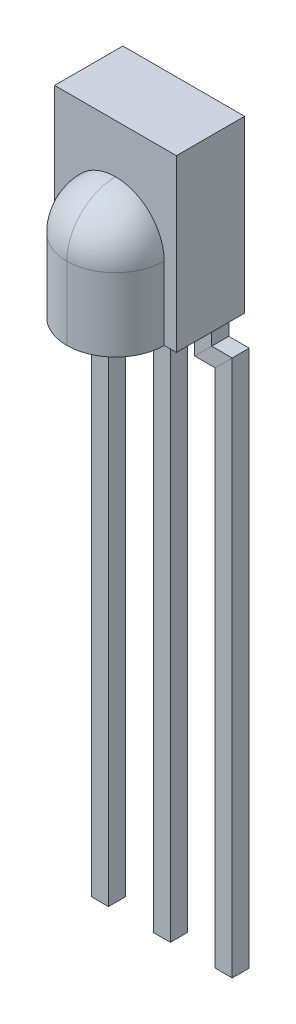
ISO-10303-21;
HEADER;
FILE_DESCRIPTION(('STEP AP214'),'2;1');
FILE_NAME('part.step','',(''),(''),'','','');
FILE_SCHEMA(('AUTOMOTIVE_DESIGN { 1 0 10303 214 1 1 1 1 }'));
ENDSEC;
DATA;
#1=APPLICATION_CONTEXT('core data for automotive mechanical design processes');
#2=APPLICATION_PROTOCOL_DEFINITION('international standard','automotive_design',2000,#1);
#3=PRODUCT_CONTEXT('',#1,'mechanical');
#4=PRODUCT('Part','Part','',(#3));
#5=PRODUCT_RELATED_PRODUCT_CATEGORY('part','',(#4));
#6=PRODUCT_DEFINITION_FORMATION('','',#4);
#7=PRODUCT_DEFINITION_CONTEXT('part definition',#1,'design');
#8=PRODUCT_DEFINITION('design','',#6,#7);
#9=PRODUCT_DEFINITION_SHAPE('','',#8);
#10=(LENGTH_UNIT() NAMED_UNIT(*) SI_UNIT(.MILLI.,.METRE.));
#11=(NAMED_UNIT(*) PLANE_ANGLE_UNIT() SI_UNIT($,.RADIAN.));
#12=(NAMED_UNIT(*) SI_UNIT($,.STERADIAN.) SOLID_ANGLE_UNIT());
#13=UNCERTAINTY_MEASURE_WITH_UNIT(LENGTH_MEASURE(1.E-05),#10,'distance_accuracy_value','');
#14=(GEOMETRIC_REPRESENTATION_CONTEXT(3) GLOBAL_UNCERTAINTY_ASSIGNED_CONTEXT((#13)) GLOBAL_UNIT_ASSIGNED_CONTEXT((#10,
#11,#12)) REPRESENTATION_CONTEXT('',''));
#15=CARTESIAN_POINT('',(0.,0.,0.));
#16=DIRECTION('',(0.,0.,1.));
#17=DIRECTION('',(1.,0.,0.));
#18=AXIS2_PLACEMENT_3D('',#15,#16,#17);
#19=CARTESIAN_POINT('',(0.,-23.0026628893266,0.));
#20=DIRECTION('',(0.,-1.,0.));
#21=DIRECTION('',(0.,0.,-1.));
#22=AXIS2_PLACEMENT_3D('',#19,#20,#21);
#23=PLANE('',#22);
#24=DIRECTION('',(0.,0.,1.));
#25=VECTOR('',#24,1.);
#26=CARTESIAN_POINT('',(2.85,-23.0026628893266,0.2));
#27=LINE('',#26,#25);
#28=CARTESIAN_POINT('',(2.85,-23.0026628893266,0.2));
#29=VERTEX_POINT('',#28);
#30=CARTESIAN_POINT('',(2.85,-23.0026628893266,0.9));
#31=VERTEX_POINT('',#30);
#32=EDGE_CURVE('E10',#29,#31,#27,.T.);
#33=ORIENTED_EDGE('',*,*,#32,.T.);
#34=DIRECTION('',(-1.,0.,0.));
#35=VECTOR('',#34,1.);
#36=CARTESIAN_POINT('',(2.85,-23.0026628893266,0.9));
#37=LINE('',#36,#35);
#38=CARTESIAN_POINT('',(2.15,-23.0026628893266,0.9));
#39=VERTEX_POINT('',#38);
#40=EDGE_CURVE('E377',#31,#39,#37,.T.);
#41=ORIENTED_EDGE('',*,*,#40,.T.);
#42=DIRECTION('',(0.,0.,-1.));
#43=VECTOR('',#42,1.);
#44=CARTESIAN_POINT('',(2.15,-23.0026628893266,0.2));
#45=LINE('',#44,#43);
#46=CARTESIAN_POINT('',(2.15,-23.0026628893266,0.2));
#47=VERTEX_POINT('',#46);
#48=EDGE_CURVE('E350',#39,#47,#45,.T.);
#49=ORIENTED_EDGE('',*,*,#48,.T.);
#50=DIRECTION('',(1.,0.,0.));
#51=VECTOR('',#50,1.);
#52=CARTESIAN_POINT('',(2.85,-23.0026628893266,0.2));
#53=LINE('',#52,#51);
#54=EDGE_CURVE('E20',#47,#29,#53,.T.);
#55=ORIENTED_EDGE('',*,*,#54,.T.);
#56=EDGE_LOOP('',(#33,#41,#49,#55));
#57=FACE_BOUND('',#56,.T.);
#58=ADVANCED_FACE('F16',(#57),#23,.T.);
#59=CARTESIAN_POINT('',(2.85,0.,0.2));
#60=DIRECTION('',(1.,0.,0.));
#61=DIRECTION('',(0.,-1.,0.));
#62=AXIS2_PLACEMENT_3D('',#59,#60,#61);
#63=PLANE('',#62);
#64=DIRECTION('',(0.,-1.,0.));
#65=VECTOR('',#64,1.);
#66=CARTESIAN_POINT('',(2.85,0.,0.9));
#67=LINE('',#66,#65);
#68=CARTESIAN_POINT('',(2.85,0.,0.9));
#69=VERTEX_POINT('',#68);
#70=EDGE_CURVE('E27',#69,#31,#67,.T.);
#71=ORIENTED_EDGE('',*,*,#70,.T.);
#72=ORIENTED_EDGE('',*,*,#32,.F.);
#73=DIRECTION('',(0.,-1.,0.));
#74=VECTOR('',#73,1.);
#75=CARTESIAN_POINT('',(2.85,0.,0.2));
#76=LINE('',#75,#74);
#77=CARTESIAN_POINT('',(2.85,0.,0.2));
#78=VERTEX_POINT('',#77);
#79=EDGE_CURVE('E168',#78,#29,#76,.T.);
#80=ORIENTED_EDGE('',*,*,#79,.F.);
#81=DIRECTION('',(0.,0.,1.));
#82=VECTOR('',#81,1.);
#83=CARTESIAN_POINT('',(2.85,0.,0.2));
#84=LINE('',#83,#82);
#85=EDGE_CURVE('E333',#78,#69,#84,.T.);
#86=ORIENTED_EDGE('',*,*,#85,.T.);
#87=EDGE_LOOP('',(#71,#72,#80,#86));
#88=FACE_BOUND('',#87,.T.);
#89=ADVANCED_FACE('F1125',(#88),#63,.T.);
#90=CARTESIAN_POINT('',(2.85,0.,0.9));
#91=DIRECTION('',(0.,0.,1.));
#92=DIRECTION('',(1.,0.,0.));
#93=AXIS2_PLACEMENT_3D('',#90,#91,#92);
#94=PLANE('',#93);
#95=DIRECTION('',(0.,-1.,0.));
#96=VECTOR('',#95,1.);
#97=CARTESIAN_POINT('',(2.15,0.,0.9));
#98=LINE('',#97,#96);
#99=CARTESIAN_POINT('',(2.15,0.,0.9));
#100=VERTEX_POINT('',#99);
#101=EDGE_CURVE('E155',#100,#39,#98,.T.);
#102=ORIENTED_EDGE('',*,*,#101,.T.);
#103=ORIENTED_EDGE('',*,*,#40,.F.);
#104=ORIENTED_EDGE('',*,*,#70,.F.);
#105=DIRECTION('',(-1.,0.,0.));
#106=VECTOR('',#105,1.);
#107=CARTESIAN_POINT('',(2.85,0.,0.9));
#108=LINE('',#107,#106);
#109=EDGE_CURVE('E336',#69,#100,#108,.T.);
#110=ORIENTED_EDGE('',*,*,#109,.T.);
#111=EDGE_LOOP('',(#102,#103,#104,#110));
#112=FACE_BOUND('',#111,.T.);
#113=ADVANCED_FACE('F1075',(#112),#94,.T.);
#114=CARTESIAN_POINT('',(2.15,0.,0.2));
#115=DIRECTION('',(-1.,0.,0.));
#116=DIRECTION('',(0.,0.,1.));
#117=AXIS2_PLACEMENT_3D('',#114,#115,#116);
#118=PLANE('',#117);
#119=DIRECTION('',(0.,-1.,0.));
#120=VECTOR('',#119,1.);
#121=CARTESIAN_POINT('',(2.15,0.,0.2));
#122=LINE('',#121,#120);
#123=CARTESIAN_POINT('',(2.15,0.,0.2));
#124=VERTEX_POINT('',#123);
#125=EDGE_CURVE('E351',#124,#47,#122,.T.);
#126=ORIENTED_EDGE('',*,*,#125,.T.);
#127=ORIENTED_EDGE('',*,*,#48,.F.);
#128=ORIENTED_EDGE('',*,*,#101,.F.);
#129=DIRECTION('',(0.,0.,-1.));
#130=VECTOR('',#129,1.);
#131=CARTESIAN_POINT('',(2.15,0.,0.2));
#132=LINE('',#131,#130);
#133=EDGE_CURVE('E332',#100,#124,#132,.T.);
#134=ORIENTED_EDGE('',*,*,#133,.T.);
#135=EDGE_LOOP('',(#126,#127,#128,#134));
#136=FACE_BOUND('',#135,.T.);
#137=ADVANCED_FACE('F1003',(#136),#118,.T.);
#138=CARTESIAN_POINT('',(2.85,0.,0.2));
#139=DIRECTION('',(0.,0.,-1.));
#140=DIRECTION('',(0.,-1.,0.));
#141=AXIS2_PLACEMENT_3D('',#138,#139,#140);
#142=PLANE('',#141);
#143=ORIENTED_EDGE('',*,*,#54,.F.);
#144=ORIENTED_EDGE('',*,*,#125,.F.);
#145=DIRECTION('',(1.,0.,0.));
#146=VECTOR('',#145,1.);
#147=CARTESIAN_POINT('',(2.85,0.,0.2));
#148=LINE('',#147,#146);
#149=EDGE_CURVE('E329',#124,#78,#148,.T.);
#150=ORIENTED_EDGE('',*,*,#149,.T.);
#151=ORIENTED_EDGE('',*,*,#79,.T.);
#152=EDGE_LOOP('',(#143,#144,#150,#151));
#153=FACE_BOUND('',#152,.T.);
#154=ADVANCED_FACE('F998',(#153),#142,.T.);
#155=CARTESIAN_POINT('',(4.16,-23.,0.));
#156=DIRECTION('',(0.,-1.,0.));
#157=DIRECTION('',(0.,0.,-1.));
#158=AXIS2_PLACEMENT_3D('',#155,#156,#157);
#159=PLANE('',#158);
#160=DIRECTION('',(0.,0.,1.));
#161=VECTOR('',#160,1.);
#162=CARTESIAN_POINT('',(0.31,-23.,0.9));
#163=LINE('',#162,#161);
#164=CARTESIAN_POINT('',(0.31,-23.,0.2));
#165=VERTEX_POINT('',#164);
#166=CARTESIAN_POINT('',(0.31,-23.,0.9));
#167=VERTEX_POINT('',#166);
#168=EDGE_CURVE('E460',#165,#167,#163,.T.);
#169=ORIENTED_EDGE('',*,*,#168,.T.);
#170=DIRECTION('',(-1.,0.,0.));
#171=VECTOR('',#170,1.);
#172=CARTESIAN_POINT('',(0.31,-23.,0.9));
#173=LINE('',#172,#171);
#174=CARTESIAN_POINT('',(-0.39,-23.,0.9));
#175=VERTEX_POINT('',#174);
#176=EDGE_CURVE('E365',#167,#175,#173,.T.);
#177=ORIENTED_EDGE('',*,*,#176,.T.);
#178=DIRECTION('',(0.,0.,-1.));
#179=VECTOR('',#178,1.);
#180=CARTESIAN_POINT('',(-0.39,-23.,0.9));
#181=LINE('',#180,#179);
#182=CARTESIAN_POINT('',(-0.39,-23.,0.2));
#183=VERTEX_POINT('',#182);
#184=EDGE_CURVE('E543',#175,#183,#181,.T.);
#185=ORIENTED_EDGE('',*,*,#184,.T.);
#186=DIRECTION('',(1.,0.,0.));
#187=VECTOR('',#186,1.);
#188=CARTESIAN_POINT('',(0.31,-23.,0.2));
#189=LINE('',#188,#187);
#190=EDGE_CURVE('E345',#183,#165,#189,.T.);
#191=ORIENTED_EDGE('',*,*,#190,.T.);
#192=EDGE_LOOP('',(#169,#177,#185,#191));
#193=FACE_BOUND('',#192,.T.);
#194=ADVANCED_FACE('F1002',(#193),#159,.T.);
#195=CARTESIAN_POINT('',(-0.39,-0.815,0.9));
#196=DIRECTION('',(-1.,0.,0.));
#197=DIRECTION('',(0.,1.,0.));
#198=AXIS2_PLACEMENT_3D('',#195,#196,#197);
#199=PLANE('',#198);
#200=DIRECTION('',(0.,0.,1.));
#201=VECTOR('',#200,1.);
#202=CARTESIAN_POINT('',(-0.39,-0.95,0.9));
#203=LINE('',#202,#201);
#204=CARTESIAN_POINT('',(-0.39,-0.95,0.2));
#205=VERTEX_POINT('',#204);
#206=CARTESIAN_POINT('',(-0.39,-0.95,0.9));
#207=VERTEX_POINT('',#206);
#208=EDGE_CURVE('E441',#205,#207,#203,.T.);
#209=ORIENTED_EDGE('',*,*,#208,.F.);
#210=DIRECTION('',(0.,-1.,0.));
#211=VECTOR('',#210,1.);
#212=CARTESIAN_POINT('',(-0.39,-0.815,0.2));
#213=LINE('',#212,#211);
#214=EDGE_CURVE('E75',#205,#183,#213,.T.);
#215=ORIENTED_EDGE('',*,*,#214,.T.);
#216=ORIENTED_EDGE('',*,*,#184,.F.);
#217=DIRECTION('',(0.,-1.,0.));
#218=VECTOR('',#217,1.);
#219=CARTESIAN_POINT('',(-0.39,-0.815,0.9));
#220=LINE('',#219,#218);
#221=EDGE_CURVE('E369',#207,#175,#220,.T.);
#222=ORIENTED_EDGE('',*,*,#221,.F.);
#223=EDGE_LOOP('',(#209,#215,#216,#222));
#224=FACE_BOUND('',#223,.T.);
#225=ADVANCED_FACE('F1305',(#224),#199,.T.);
#226=CARTESIAN_POINT('',(0.31,-0.815,0.2));
#227=DIRECTION('',(0.,0.,-1.));
#228=DIRECTION('',(0.,-1.,0.));
#229=AXIS2_PLACEMENT_3D('',#226,#227,#228);
#230=PLANE('',#229);
#231=DIRECTION('',(-0.707106781186548,0.707106781186548,0.));
#232=VECTOR('',#231,1.);
#233=CARTESIAN_POINT('',(0.7975,-2.1375,0.2));
#234=LINE('',#233,#232);
#235=CARTESIAN_POINT('',(0.31,-1.65,0.2));
#236=VERTEX_POINT('',#235);
#237=EDGE_CURVE('E362',#236,#205,#234,.T.);
#238=ORIENTED_EDGE('',*,*,#237,.F.);
#239=DIRECTION('',(0.,-1.,0.));
#240=VECTOR('',#239,1.);
#241=CARTESIAN_POINT('',(0.31,-0.815,0.2));
#242=LINE('',#241,#240);
#243=EDGE_CURVE('E348',#236,#165,#242,.T.);
#244=ORIENTED_EDGE('',*,*,#243,.T.);
#245=ORIENTED_EDGE('',*,*,#190,.F.);
#246=ORIENTED_EDGE('',*,*,#214,.F.);
#247=EDGE_LOOP('',(#238,#244,#245,#246));
#248=FACE_BOUND('',#247,.T.);
#249=ADVANCED_FACE('F1327',(#248),#230,.T.);
#250=CARTESIAN_POINT('',(0.31,-0.815,0.9));
#251=DIRECTION('',(1.,0.,0.));
#252=DIRECTION('',(0.,0.,-1.));
#253=AXIS2_PLACEMENT_3D('',#250,#251,#252);
#254=PLANE('',#253);
#255=DIRECTION('',(0.,0.,-1.));
#256=VECTOR('',#255,1.);
#257=CARTESIAN_POINT('',(0.31,-1.65,0.9));
#258=LINE('',#257,#256);
#259=CARTESIAN_POINT('',(0.31,-1.65,0.9));
#260=VERTEX_POINT('',#259);
#261=EDGE_CURVE('E450',#260,#236,#258,.T.);
#262=ORIENTED_EDGE('',*,*,#261,.F.);
#263=DIRECTION('',(0.,-1.,0.));
#264=VECTOR('',#263,1.);
#265=CARTESIAN_POINT('',(0.31,-0.815,0.9));
#266=LINE('',#265,#264);
#267=EDGE_CURVE('E368',#260,#167,#266,.T.);
#268=ORIENTED_EDGE('',*,*,#267,.T.);
#269=ORIENTED_EDGE('',*,*,#168,.F.);
#270=ORIENTED_EDGE('',*,*,#243,.F.);
#271=EDGE_LOOP('',(#262,#268,#269,#270));
#272=FACE_BOUND('',#271,.T.);
#273=ADVANCED_FACE('F610',(#272),#254,.T.);
#274=CARTESIAN_POINT('',(0.31,-0.815,0.9));
#275=DIRECTION('',(0.,0.,1.));
#276=DIRECTION('',(1.,0.,0.));
#277=AXIS2_PLACEMENT_3D('',#274,#275,#276);
#278=PLANE('',#277);
#279=DIRECTION('',(0.707106781186548,-0.707106781186548,0.));
#280=VECTOR('',#279,1.);
#281=CARTESIAN_POINT('',(0.7975,-2.1375,0.9));
#282=LINE('',#281,#280);
#283=EDGE_CURVE('E453',#207,#260,#282,.T.);
#284=ORIENTED_EDGE('',*,*,#283,.F.);
#285=ORIENTED_EDGE('',*,*,#221,.T.);
#286=ORIENTED_EDGE('',*,*,#176,.F.);
#287=ORIENTED_EDGE('',*,*,#267,.F.);
#288=EDGE_LOOP('',(#284,#285,#286,#287));
#289=FACE_BOUND('',#288,.T.);
#290=ADVANCED_FACE('F1215',(#289),#278,.T.);
#291=CARTESIAN_POINT('',(1.285,-1.65,0.9));
#292=DIRECTION('',(0.,0.,1.));
#293=DIRECTION('',(1.,0.,0.));
#294=AXIS2_PLACEMENT_3D('',#291,#292,#293);
#295=PLANE('',#294);
#296=DIRECTION('',(-1.,0.,0.));
#297=VECTOR('',#296,1.);
#298=CARTESIAN_POINT('',(1.285,-0.95,0.9));
#299=LINE('',#298,#297);
#300=CARTESIAN_POINT('',(0.45,-0.95,0.9));
#301=VERTEX_POINT('',#300);
#302=EDGE_CURVE('E426',#301,#207,#299,.T.);
#303=ORIENTED_EDGE('',*,*,#302,.T.);
#304=ORIENTED_EDGE('',*,*,#283,.T.);
#305=DIRECTION('',(-1.,0.,0.));
#306=VECTOR('',#305,1.);
#307=CARTESIAN_POINT('',(1.285,-1.65,0.9));
#308=LINE('',#307,#306);
#309=CARTESIAN_POINT('',(1.15,-1.65,0.9));
#310=VERTEX_POINT('',#309);
#311=EDGE_CURVE('E90',#310,#260,#308,.T.);
#312=ORIENTED_EDGE('',*,*,#311,.F.);
#313=DIRECTION('',(0.707106781186548,-0.707106781186548,0.));
#314=VECTOR('',#313,1.);
#315=CARTESIAN_POINT('',(0.325,-0.825,0.9));
#316=LINE('',#315,#314);
#317=EDGE_CURVE('E307',#301,#310,#316,.T.);
#318=ORIENTED_EDGE('',*,*,#317,.F.);
#319=EDGE_LOOP('',(#303,#304,#312,#318));
#320=FACE_BOUND('',#319,.T.);
#321=ADVANCED_FACE('F603',(#320),#295,.T.);
#322=CARTESIAN_POINT('',(1.285,-1.65,0.9));
#323=DIRECTION('',(0.,-1.,0.));
#324=DIRECTION('',(0.,0.,-1.));
#325=AXIS2_PLACEMENT_3D('',#322,#323,#324);
#326=PLANE('',#325);
#327=ORIENTED_EDGE('',*,*,#311,.T.);
#328=ORIENTED_EDGE('',*,*,#261,.T.);
#329=DIRECTION('',(-1.,0.,0.));
#330=VECTOR('',#329,1.);
#331=CARTESIAN_POINT('',(1.285,-1.65,0.2));
#332=LINE('',#331,#330);
#333=CARTESIAN_POINT('',(1.15,-1.65,0.2));
#334=VERTEX_POINT('',#333);
#335=EDGE_CURVE('E103',#334,#236,#332,.T.);
#336=ORIENTED_EDGE('',*,*,#335,.F.);
#337=DIRECTION('',(0.,0.,-1.));
#338=VECTOR('',#337,1.);
#339=CARTESIAN_POINT('',(1.15,-1.65,0.9));
#340=LINE('',#339,#338);
#341=EDGE_CURVE('E304',#310,#334,#340,.T.);
#342=ORIENTED_EDGE('',*,*,#341,.F.);
#343=EDGE_LOOP('',(#327,#328,#336,#342));
#344=FACE_BOUND('',#343,.T.);
#345=ADVANCED_FACE('F613',(#344),#326,.T.);
#346=CARTESIAN_POINT('',(1.285,-1.65,0.2));
#347=DIRECTION('',(0.,0.,-1.));
#348=DIRECTION('',(0.,-1.,0.));
#349=AXIS2_PLACEMENT_3D('',#346,#347,#348);
#350=PLANE('',#349);
#351=ORIENTED_EDGE('',*,*,#335,.T.);
#352=ORIENTED_EDGE('',*,*,#237,.T.);
#353=DIRECTION('',(-1.,0.,0.));
#354=VECTOR('',#353,1.);
#355=CARTESIAN_POINT('',(1.285,-0.95,0.2));
#356=LINE('',#355,#354);
#357=CARTESIAN_POINT('',(0.45,-0.95,0.2));
#358=VERTEX_POINT('',#357);
#359=EDGE_CURVE('E445',#358,#205,#356,.T.);
#360=ORIENTED_EDGE('',*,*,#359,.F.);
#361=DIRECTION('',(-0.707106781186548,0.707106781186548,0.));
#362=VECTOR('',#361,1.);
#363=CARTESIAN_POINT('',(0.325,-0.825,0.2));
#364=LINE('',#363,#362);
#365=EDGE_CURVE('E540',#334,#358,#364,.T.);
#366=ORIENTED_EDGE('',*,*,#365,.F.);
#367=EDGE_LOOP('',(#351,#352,#360,#366));
#368=FACE_BOUND('',#367,.T.);
#369=ADVANCED_FACE('F1028',(#368),#350,.T.);
#370=CARTESIAN_POINT('',(1.285,-0.95,0.9));
#371=DIRECTION('',(0.,1.,0.));
#372=DIRECTION('',(1.,0.,0.));
#373=AXIS2_PLACEMENT_3D('',#370,#371,#372);
#374=PLANE('',#373);
#375=ORIENTED_EDGE('',*,*,#359,.T.);
#376=ORIENTED_EDGE('',*,*,#208,.T.);
#377=ORIENTED_EDGE('',*,*,#302,.F.);
#378=DIRECTION('',(0.,0.,1.));
#379=VECTOR('',#378,1.);
#380=CARTESIAN_POINT('',(0.45,-0.95,0.9));
#381=LINE('',#380,#379);
#382=EDGE_CURVE('E383',#358,#301,#381,.T.);
#383=ORIENTED_EDGE('',*,*,#382,.F.);
#384=EDGE_LOOP('',(#375,#376,#377,#383));
#385=FACE_BOUND('',#384,.T.);
#386=ADVANCED_FACE('F989',(#385),#374,.T.);
#387=CARTESIAN_POINT('',(1.15,0.,0.9));
#388=DIRECTION('',(0.,0.,1.));
#389=DIRECTION('',(1.,0.,0.));
#390=AXIS2_PLACEMENT_3D('',#387,#388,#389);
#391=PLANE('',#390);
#392=DIRECTION('',(0.,-1.,0.));
#393=VECTOR('',#392,1.);
#394=CARTESIAN_POINT('',(0.45,0.,0.9));
#395=LINE('',#394,#393);
#396=CARTESIAN_POINT('',(0.45,0.,0.9));
#397=VERTEX_POINT('',#396);
#398=EDGE_CURVE('E378',#397,#301,#395,.T.);
#399=ORIENTED_EDGE('',*,*,#398,.T.);
#400=ORIENTED_EDGE('',*,*,#317,.T.);
#401=DIRECTION('',(0.,-1.,0.));
#402=VECTOR('',#401,1.);
#403=CARTESIAN_POINT('',(1.15,0.,0.9));
#404=LINE('',#403,#402);
#405=CARTESIAN_POINT('',(1.15,0.,0.9));
#406=VERTEX_POINT('',#405);
#407=EDGE_CURVE('E308',#406,#310,#404,.T.);
#408=ORIENTED_EDGE('',*,*,#407,.F.);
#409=DIRECTION('',(-1.,0.,0.));
#410=VECTOR('',#409,1.);
#411=CARTESIAN_POINT('',(1.15,0.,0.9));
#412=LINE('',#411,#410);
#413=EDGE_CURVE('E486',#406,#397,#412,.T.);
#414=ORIENTED_EDGE('',*,*,#413,.T.);
#415=EDGE_LOOP('',(#399,#400,#408,#414));
#416=FACE_BOUND('',#415,.T.);
#417=ADVANCED_FACE('F984',(#416),#391,.T.);
#418=CARTESIAN_POINT('',(1.15,0.,0.9));
#419=DIRECTION('',(1.,0.,0.));
#420=DIRECTION('',(0.,0.,-1.));
#421=AXIS2_PLACEMENT_3D('',#418,#419,#420);
#422=PLANE('',#421);
#423=ORIENTED_EDGE('',*,*,#407,.T.);
#424=ORIENTED_EDGE('',*,*,#341,.T.);
#425=DIRECTION('',(0.,-1.,0.));
#426=VECTOR('',#425,1.);
#427=CARTESIAN_POINT('',(1.15,0.,0.2));
#428=LINE('',#427,#426);
#429=CARTESIAN_POINT('',(1.15,0.,0.2));
#430=VERTEX_POINT('',#429);
#431=EDGE_CURVE('E382',#430,#334,#428,.T.);
#432=ORIENTED_EDGE('',*,*,#431,.F.);
#433=DIRECTION('',(0.,0.,1.));
#434=VECTOR('',#433,1.);
#435=CARTESIAN_POINT('',(1.15,0.,0.9));
#436=LINE('',#435,#434);
#437=EDGE_CURVE('E358',#430,#406,#436,.T.);
#438=ORIENTED_EDGE('',*,*,#437,.T.);
#439=EDGE_LOOP('',(#423,#424,#432,#438));
#440=FACE_BOUND('',#439,.T.);
#441=ADVANCED_FACE('F988',(#440),#422,.T.);
#442=CARTESIAN_POINT('',(1.15,0.,0.2));
#443=DIRECTION('',(0.,0.,-1.));
#444=DIRECTION('',(0.,-1.,0.));
#445=AXIS2_PLACEMENT_3D('',#442,#443,#444);
#446=PLANE('',#445);
#447=ORIENTED_EDGE('',*,*,#431,.T.);
#448=ORIENTED_EDGE('',*,*,#365,.T.);
#449=DIRECTION('',(0.,-1.,0.));
#450=VECTOR('',#449,1.);
#451=CARTESIAN_POINT('',(0.45,0.,0.2));
#452=LINE('',#451,#450);
#453=CARTESIAN_POINT('',(0.45,0.,0.2));
#454=VERTEX_POINT('',#453);
#455=EDGE_CURVE('E476',#454,#358,#452,.T.);
#456=ORIENTED_EDGE('',*,*,#455,.F.);
#457=DIRECTION('',(1.,0.,0.));
#458=VECTOR('',#457,1.);
#459=CARTESIAN_POINT('',(1.15,0.,0.2));
#460=LINE('',#459,#458);
#461=EDGE_CURVE('E353',#454,#430,#460,.T.);
#462=ORIENTED_EDGE('',*,*,#461,.T.);
#463=EDGE_LOOP('',(#447,#448,#456,#462));
#464=FACE_BOUND('',#463,.T.);
#465=ADVANCED_FACE('F1110',(#464),#446,.T.);
#466=CARTESIAN_POINT('',(0.45,0.,0.9));
#467=DIRECTION('',(-1.,0.,0.));
#468=DIRECTION('',(0.,0.,1.));
#469=AXIS2_PLACEMENT_3D('',#466,#467,#468);
#470=PLANE('',#469);
#471=ORIENTED_EDGE('',*,*,#455,.T.);
#472=ORIENTED_EDGE('',*,*,#382,.T.);
#473=ORIENTED_EDGE('',*,*,#398,.F.);
#474=DIRECTION('',(0.,0.,-1.));
#475=VECTOR('',#474,1.);
#476=CARTESIAN_POINT('',(0.45,0.,0.9));
#477=LINE('',#476,#475);
#478=EDGE_CURVE('E423',#397,#454,#477,.T.);
#479=ORIENTED_EDGE('',*,*,#478,.T.);
#480=EDGE_LOOP('',(#471,#472,#473,#479));
#481=FACE_BOUND('',#480,.T.);
#482=ADVANCED_FACE('F1088',(#481),#470,.T.);
#483=CARTESIAN_POINT('',(0.84,-23.,0.));
#484=DIRECTION('',(0.,-1.,0.));
#485=DIRECTION('',(0.,0.,-1.));
#486=AXIS2_PLACEMENT_3D('',#483,#484,#485);
#487=PLANE('',#486);
#488=DIRECTION('',(0.,0.,-1.));
#489=VECTOR('',#488,1.);
#490=CARTESIAN_POINT('',(4.69,-23.,0.9));
#491=LINE('',#490,#489);
#492=CARTESIAN_POINT('',(4.69,-23.,0.9));
#493=VERTEX_POINT('',#492);
#494=CARTESIAN_POINT('',(4.69,-23.,0.2));
#495=VERTEX_POINT('',#494);
#496=EDGE_CURVE('E183',#493,#495,#491,.T.);
#497=ORIENTED_EDGE('',*,*,#496,.T.);
#498=DIRECTION('',(1.,0.,0.));
#499=VECTOR('',#498,1.);
#500=CARTESIAN_POINT('',(4.69,-23.,0.2));
#501=LINE('',#500,#499);
#502=CARTESIAN_POINT('',(5.39,-23.,0.2));
#503=VERTEX_POINT('',#502);
#504=EDGE_CURVE('E393',#495,#503,#501,.T.);
#505=ORIENTED_EDGE('',*,*,#504,.T.);
#506=DIRECTION('',(0.,0.,1.));
#507=VECTOR('',#506,1.);
#508=CARTESIAN_POINT('',(5.39,-23.,0.9));
#509=LINE('',#508,#507);
#510=CARTESIAN_POINT('',(5.39,-23.,0.9));
#511=VERTEX_POINT('',#510);
#512=EDGE_CURVE('E194',#503,#511,#509,.T.);
#513=ORIENTED_EDGE('',*,*,#512,.T.);
#514=DIRECTION('',(-1.,0.,0.));
#515=VECTOR('',#514,1.);
#516=CARTESIAN_POINT('',(4.69,-23.,0.9));
#517=LINE('',#516,#515);
#518=EDGE_CURVE('E327',#511,#493,#517,.T.);
#519=ORIENTED_EDGE('',*,*,#518,.T.);
#520=EDGE_LOOP('',(#497,#505,#513,#519));
#521=FACE_BOUND('',#520,.T.);
#522=ADVANCED_FACE('F1083',(#521),#487,.T.);
#523=CARTESIAN_POINT('',(4.69,-0.815,0.9));
#524=DIRECTION('',(-1.,0.,0.));
#525=DIRECTION('',(0.,0.,1.));
#526=AXIS2_PLACEMENT_3D('',#523,#524,#525);
#527=PLANE('',#526);
#528=DIRECTION('',(0.,0.,1.));
#529=VECTOR('',#528,1.);
#530=CARTESIAN_POINT('',(4.69,-1.65,0.9));
#531=LINE('',#530,#529);
#532=CARTESIAN_POINT('',(4.69,-1.65,0.2));
#533=VERTEX_POINT('',#532);
#534=CARTESIAN_POINT('',(4.69,-1.65,0.9));
#535=VERTEX_POINT('',#534);
#536=EDGE_CURVE('E440',#533,#535,#531,.T.);
#537=ORIENTED_EDGE('',*,*,#536,.F.);
#538=DIRECTION('',(0.,-1.,0.));
#539=VECTOR('',#538,1.);
#540=CARTESIAN_POINT('',(4.69,-0.815,0.2));
#541=LINE('',#540,#539);
#542=EDGE_CURVE('E390',#533,#495,#541,.T.);
#543=ORIENTED_EDGE('',*,*,#542,.T.);
#544=ORIENTED_EDGE('',*,*,#496,.F.);
#545=DIRECTION('',(0.,-1.,0.));
#546=VECTOR('',#545,1.);
#547=CARTESIAN_POINT('',(4.69,-0.815,0.9));
#548=LINE('',#547,#546);
#549=EDGE_CURVE('E323',#535,#493,#548,.T.);
#550=ORIENTED_EDGE('',*,*,#549,.F.);
#551=EDGE_LOOP('',(#537,#543,#544,#550));
#552=FACE_BOUND('',#551,.T.);
#553=ADVANCED_FACE('F1087',(#552),#527,.T.);
#554=CARTESIAN_POINT('',(4.69,-0.815,0.2));
#555=DIRECTION('',(0.,0.,-1.));
#556=DIRECTION('',(-1.,0.,0.));
#557=AXIS2_PLACEMENT_3D('',#554,#555,#556);
#558=PLANE('',#557);
#559=DIRECTION('',(-0.707106781186548,-0.707106781186548,0.));
#560=VECTOR('',#559,1.);
#561=CARTESIAN_POINT('',(4.2025,-2.1375,0.2));
#562=LINE('',#561,#560);
#563=CARTESIAN_POINT('',(5.39,-0.95,0.2));
#564=VERTEX_POINT('',#563);
#565=EDGE_CURVE('E303',#564,#533,#562,.T.);
#566=ORIENTED_EDGE('',*,*,#565,.F.);
#567=DIRECTION('',(0.,-1.,0.));
#568=VECTOR('',#567,1.);
#569=CARTESIAN_POINT('',(5.39,-0.815,0.2));
#570=LINE('',#569,#568);
#571=EDGE_CURVE('E469',#564,#503,#570,.T.);
#572=ORIENTED_EDGE('',*,*,#571,.T.);
#573=ORIENTED_EDGE('',*,*,#504,.F.);
#574=ORIENTED_EDGE('',*,*,#542,.F.);
#575=EDGE_LOOP('',(#566,#572,#573,#574));
#576=FACE_BOUND('',#575,.T.);
#577=ADVANCED_FACE('F1167',(#576),#558,.T.);
#578=CARTESIAN_POINT('',(5.39,-0.815,0.9));
#579=DIRECTION('',(1.,0.,0.));
#580=DIRECTION('',(0.,-1.,0.));
#581=AXIS2_PLACEMENT_3D('',#578,#579,#580);
#582=PLANE('',#581);
#583=DIRECTION('',(0.,0.,-1.));
#584=VECTOR('',#583,1.);
#585=CARTESIAN_POINT('',(5.39,-0.95,0.9));
#586=LINE('',#585,#584);
#587=CARTESIAN_POINT('',(5.39,-0.95,0.9));
#588=VERTEX_POINT('',#587);
#589=EDGE_CURVE('E302',#588,#564,#586,.T.);
#590=ORIENTED_EDGE('',*,*,#589,.F.);
#591=DIRECTION('',(0.,-1.,0.));
#592=VECTOR('',#591,1.);
#593=CARTESIAN_POINT('',(5.39,-0.815,0.9));
#594=LINE('',#593,#592);
#595=EDGE_CURVE('E591',#588,#511,#594,.T.);
#596=ORIENTED_EDGE('',*,*,#595,.T.);
#597=ORIENTED_EDGE('',*,*,#512,.F.);
#598=ORIENTED_EDGE('',*,*,#571,.F.);
#599=EDGE_LOOP('',(#590,#596,#597,#598));
#600=FACE_BOUND('',#599,.T.);
#601=ADVANCED_FACE('F1171',(#600),#582,.T.);
#602=CARTESIAN_POINT('',(4.69,-0.815,0.9));
#603=DIRECTION('',(0.,0.,1.));
#604=DIRECTION('',(1.,0.,0.));
#605=AXIS2_PLACEMENT_3D('',#602,#603,#604);
#606=PLANE('',#605);
#607=DIRECTION('',(0.707106781186548,0.707106781186548,0.));
#608=VECTOR('',#607,1.);
#609=CARTESIAN_POINT('',(4.2025,-2.1375,0.9));
#610=LINE('',#609,#608);
#611=EDGE_CURVE('E328',#535,#588,#610,.T.);
#612=ORIENTED_EDGE('',*,*,#611,.F.);
#613=ORIENTED_EDGE('',*,*,#549,.T.);
#614=ORIENTED_EDGE('',*,*,#518,.F.);
#615=ORIENTED_EDGE('',*,*,#595,.F.);
#616=EDGE_LOOP('',(#612,#613,#614,#615));
#617=FACE_BOUND('',#616,.T.);
#618=ADVANCED_FACE('F1234',(#617),#606,.T.);
#619=CARTESIAN_POINT('',(3.715,-1.65,0.9));
#620=DIRECTION('',(0.,0.,1.));
#621=DIRECTION('',(1.,0.,0.));
#622=AXIS2_PLACEMENT_3D('',#619,#620,#621);
#623=PLANE('',#622);
#624=DIRECTION('',(1.,0.,0.));
#625=VECTOR('',#624,1.);
#626=CARTESIAN_POINT('',(3.715,-1.65,0.9));
#627=LINE('',#626,#625);
#628=CARTESIAN_POINT('',(3.85,-1.65,0.9));
#629=VERTEX_POINT('',#628);
#630=EDGE_CURVE('E319',#629,#535,#627,.T.);
#631=ORIENTED_EDGE('',*,*,#630,.T.);
#632=ORIENTED_EDGE('',*,*,#611,.T.);
#633=DIRECTION('',(1.,0.,0.));
#634=VECTOR('',#633,1.);
#635=CARTESIAN_POINT('',(3.715,-0.95,0.9));
#636=LINE('',#635,#634);
#637=CARTESIAN_POINT('',(4.55,-0.95,0.9));
#638=VERTEX_POINT('',#637);
#639=EDGE_CURVE('E298',#638,#588,#636,.T.);
#640=ORIENTED_EDGE('',*,*,#639,.F.);
#641=DIRECTION('',(0.707106781186548,0.707106781186548,0.));
#642=VECTOR('',#641,1.);
#643=CARTESIAN_POINT('',(4.675,-0.825,0.9));
#644=LINE('',#643,#642);
#645=EDGE_CURVE('E343',#629,#638,#644,.T.);
#646=ORIENTED_EDGE('',*,*,#645,.F.);
#647=EDGE_LOOP('',(#631,#632,#640,#646));
#648=FACE_BOUND('',#647,.T.);
#649=ADVANCED_FACE('F18',(#648),#623,.T.);
#650=CARTESIAN_POINT('',(3.715,-0.95,0.9));
#651=DIRECTION('',(0.,1.,0.));
#652=DIRECTION('',(1.,0.,0.));
#653=AXIS2_PLACEMENT_3D('',#650,#651,#652);
#654=PLANE('',#653);
#655=ORIENTED_EDGE('',*,*,#639,.T.);
#656=ORIENTED_EDGE('',*,*,#589,.T.);
#657=DIRECTION('',(1.,0.,0.));
#658=VECTOR('',#657,1.);
#659=CARTESIAN_POINT('',(3.715,-0.95,0.2));
#660=LINE('',#659,#658);
#661=CARTESIAN_POINT('',(4.55,-0.95,0.2));
#662=VERTEX_POINT('',#661);
#663=EDGE_CURVE('E315',#662,#564,#660,.T.);
#664=ORIENTED_EDGE('',*,*,#663,.F.);
#665=DIRECTION('',(0.,0.,-1.));
#666=VECTOR('',#665,1.);
#667=CARTESIAN_POINT('',(4.55,-0.95,0.9));
#668=LINE('',#667,#666);
#669=EDGE_CURVE('E339',#638,#662,#668,.T.);
#670=ORIENTED_EDGE('',*,*,#669,.F.);
#671=EDGE_LOOP('',(#655,#656,#664,#670));
#672=FACE_BOUND('',#671,.T.);
#673=ADVANCED_FACE('F1037',(#672),#654,.T.);
#674=CARTESIAN_POINT('',(3.715,-1.65,0.2));
#675=DIRECTION('',(0.,0.,-1.));
#676=DIRECTION('',(0.,-1.,0.));
#677=AXIS2_PLACEMENT_3D('',#674,#675,#676);
#678=PLANE('',#677);
#679=ORIENTED_EDGE('',*,*,#663,.T.);
#680=ORIENTED_EDGE('',*,*,#565,.T.);
#681=DIRECTION('',(1.,0.,0.));
#682=VECTOR('',#681,1.);
#683=CARTESIAN_POINT('',(3.715,-1.65,0.2));
#684=LINE('',#683,#682);
#685=CARTESIAN_POINT('',(3.85,-1.65,0.2));
#686=VERTEX_POINT('',#685);
#687=EDGE_CURVE('E446',#686,#533,#684,.T.);
#688=ORIENTED_EDGE('',*,*,#687,.F.);
#689=DIRECTION('',(-0.707106781186548,-0.707106781186548,0.));
#690=VECTOR('',#689,1.);
#691=CARTESIAN_POINT('',(4.675,-0.825,0.2));
#692=LINE('',#691,#690);
#693=EDGE_CURVE('E371',#662,#686,#692,.T.);
#694=ORIENTED_EDGE('',*,*,#693,.F.);
#695=EDGE_LOOP('',(#679,#680,#688,#694));
#696=FACE_BOUND('',#695,.T.);
#697=ADVANCED_FACE('F1041',(#696),#678,.T.);
#698=CARTESIAN_POINT('',(3.715,-1.65,0.9));
#699=DIRECTION('',(0.,-1.,0.));
#700=DIRECTION('',(0.,0.,-1.));
#701=AXIS2_PLACEMENT_3D('',#698,#699,#700);
#702=PLANE('',#701);
#703=ORIENTED_EDGE('',*,*,#687,.T.);
#704=ORIENTED_EDGE('',*,*,#536,.T.);
#705=ORIENTED_EDGE('',*,*,#630,.F.);
#706=DIRECTION('',(0.,0.,1.));
#707=VECTOR('',#706,1.);
#708=CARTESIAN_POINT('',(3.85,-1.65,0.9));
#709=LINE('',#708,#707);
#710=EDGE_CURVE('E314',#686,#629,#709,.T.);
#711=ORIENTED_EDGE('',*,*,#710,.F.);
#712=EDGE_LOOP('',(#703,#704,#705,#711));
#713=FACE_BOUND('',#712,.T.);
#714=ADVANCED_FACE('F1060',(#713),#702,.T.);
#715=CARTESIAN_POINT('',(3.85,0.,0.9));
#716=DIRECTION('',(0.,0.,1.));
#717=DIRECTION('',(1.,0.,0.));
#718=AXIS2_PLACEMENT_3D('',#715,#716,#717);
#719=PLANE('',#718);
#720=DIRECTION('',(0.,-1.,0.));
#721=VECTOR('',#720,1.);
#722=CARTESIAN_POINT('',(3.85,0.,0.9));
#723=LINE('',#722,#721);
#724=CARTESIAN_POINT('',(3.85,0.,0.9));
#725=VERTEX_POINT('',#724);
#726=EDGE_CURVE('E309',#725,#629,#723,.T.);
#727=ORIENTED_EDGE('',*,*,#726,.T.);
#728=ORIENTED_EDGE('',*,*,#645,.T.);
#729=DIRECTION('',(0.,-1.,0.));
#730=VECTOR('',#729,1.);
#731=CARTESIAN_POINT('',(4.55,0.,0.9));
#732=LINE('',#731,#730);
#733=CARTESIAN_POINT('',(4.55,0.,0.9));
#734=VERTEX_POINT('',#733);
#735=EDGE_CURVE('E344',#734,#638,#732,.T.);
#736=ORIENTED_EDGE('',*,*,#735,.F.);
#737=DIRECTION('',(-1.,0.,0.));
#738=VECTOR('',#737,1.);
#739=CARTESIAN_POINT('',(3.85,0.,0.9));
#740=LINE('',#739,#738);
#741=EDGE_CURVE('E490',#734,#725,#740,.T.);
#742=ORIENTED_EDGE('',*,*,#741,.T.);
#743=EDGE_LOOP('',(#727,#728,#736,#742));
#744=FACE_BOUND('',#743,.T.);
#745=ADVANCED_FACE('F974',(#744),#719,.T.);
#746=CARTESIAN_POINT('',(4.55,0.,0.9));
#747=DIRECTION('',(1.,0.,0.));
#748=DIRECTION('',(0.,1.,0.));
#749=AXIS2_PLACEMENT_3D('',#746,#747,#748);
#750=PLANE('',#749);
#751=ORIENTED_EDGE('',*,*,#735,.T.);
#752=ORIENTED_EDGE('',*,*,#669,.T.);
#753=DIRECTION('',(0.,-1.,0.));
#754=VECTOR('',#753,1.);
#755=CARTESIAN_POINT('',(4.55,0.,0.2));
#756=LINE('',#755,#754);
#757=CARTESIAN_POINT('',(4.55,0.,0.2));
#758=VERTEX_POINT('',#757);
#759=EDGE_CURVE('E313',#758,#662,#756,.T.);
#760=ORIENTED_EDGE('',*,*,#759,.F.);
#761=DIRECTION('',(0.,0.,1.));
#762=VECTOR('',#761,1.);
#763=CARTESIAN_POINT('',(4.55,0.,0.9));
#764=LINE('',#763,#762);
#765=EDGE_CURVE('E434',#758,#734,#764,.T.);
#766=ORIENTED_EDGE('',*,*,#765,.T.);
#767=EDGE_LOOP('',(#751,#752,#760,#766));
#768=FACE_BOUND('',#767,.T.);
#769=ADVANCED_FACE('F968',(#768),#750,.T.);
#770=CARTESIAN_POINT('',(3.85,0.,0.2));
#771=DIRECTION('',(0.,0.,-1.));
#772=DIRECTION('',(-1.,0.,0.));
#773=AXIS2_PLACEMENT_3D('',#770,#771,#772);
#774=PLANE('',#773);
#775=ORIENTED_EDGE('',*,*,#759,.T.);
#776=ORIENTED_EDGE('',*,*,#693,.T.);
#777=DIRECTION('',(0.,-1.,0.));
#778=VECTOR('',#777,1.);
#779=CARTESIAN_POINT('',(3.85,0.,0.2));
#780=LINE('',#779,#778);
#781=CARTESIAN_POINT('',(3.85,0.,0.2));
#782=VERTEX_POINT('',#781);
#783=EDGE_CURVE('E430',#782,#686,#780,.T.);
#784=ORIENTED_EDGE('',*,*,#783,.F.);
#785=DIRECTION('',(1.,0.,0.));
#786=VECTOR('',#785,1.);
#787=CARTESIAN_POINT('',(3.85,0.,0.2));
#788=LINE('',#787,#786);
#789=EDGE_CURVE('E420',#782,#758,#788,.T.);
#790=ORIENTED_EDGE('',*,*,#789,.T.);
#791=EDGE_LOOP('',(#775,#776,#784,#790));
#792=FACE_BOUND('',#791,.T.);
#793=ADVANCED_FACE('F973',(#792),#774,.T.);
#794=CARTESIAN_POINT('',(3.85,0.,0.9));
#795=DIRECTION('',(-1.,0.,0.));
#796=DIRECTION('',(0.,0.,1.));
#797=AXIS2_PLACEMENT_3D('',#794,#795,#796);
#798=PLANE('',#797);
#799=ORIENTED_EDGE('',*,*,#783,.T.);
#800=ORIENTED_EDGE('',*,*,#710,.T.);
#801=ORIENTED_EDGE('',*,*,#726,.F.);
#802=DIRECTION('',(0.,0.,-1.));
#803=VECTOR('',#802,1.);
#804=CARTESIAN_POINT('',(3.85,0.,0.9));
#805=LINE('',#804,#803);
#806=EDGE_CURVE('E357',#725,#782,#805,.T.);
#807=ORIENTED_EDGE('',*,*,#806,.T.);
#808=EDGE_LOOP('',(#799,#800,#801,#807));
#809=FACE_BOUND('',#808,.T.);
#810=ADVANCED_FACE('F1250',(#809),#798,.T.);
#811=CARTESIAN_POINT('',(2.5,0.,2.8));
#812=DIRECTION('',(0.,1.,0.));
#813=DIRECTION('',(-1.,0.,0.));
#814=AXIS2_PLACEMENT_3D('',#811,#812,#813);
#815=CYLINDRICAL_SURFACE('',#814,2.);
#816=CARTESIAN_POINT('',(2.5,0.,2.8));
#817=DIRECTION('',(0.,-1.,0.));
#818=DIRECTION('',(0.,0.,1.));
#819=AXIS2_PLACEMENT_3D('',#816,#817,#818);
#820=CIRCLE('',#819,2.);
#821=CARTESIAN_POINT('',(4.5,0.,2.8));
#822=VERTEX_POINT('',#821);
#823=CARTESIAN_POINT('',(2.5,0.,4.8));
#824=VERTEX_POINT('',#823);
#825=EDGE_CURVE('E322',#822,#824,#820,.T.);
#826=ORIENTED_EDGE('',*,*,#825,.F.);
#827=DIRECTION('',(0.,1.,0.));
#828=VECTOR('',#827,1.);
#829=CARTESIAN_POINT('',(4.5,0.,2.8));
#830=LINE('',#829,#828);
#831=CARTESIAN_POINT('',(4.5,3.,2.8));
#832=VERTEX_POINT('',#831);
#833=EDGE_CURVE('E388',#822,#832,#830,.T.);
#834=ORIENTED_EDGE('',*,*,#833,.T.);
#835=CARTESIAN_POINT('',(2.5,3.,2.8));
#836=DIRECTION('',(0.,-1.,0.));
#837=DIRECTION('',(-1.,0.,0.));
#838=AXIS2_PLACEMENT_3D('',#835,#836,#837);
#839=CIRCLE('',#838,2.);
#840=CARTESIAN_POINT('',(2.5,3.,4.8));
#841=VERTEX_POINT('',#840);
#842=EDGE_CURVE('E404',#832,#841,#839,.T.);
#843=ORIENTED_EDGE('',*,*,#842,.T.);
#844=DIRECTION('',(0.,-1.,0.));
#845=VECTOR('',#844,1.);
#846=CARTESIAN_POINT('',(2.5,0.,4.8));
#847=LINE('',#846,#845);
#848=EDGE_CURVE('E401',#841,#824,#847,.T.);
#849=ORIENTED_EDGE('',*,*,#848,.T.);
#850=EDGE_LOOP('',(#826,#834,#843,#849));
#851=FACE_BOUND('',#850,.T.);
#852=ADVANCED_FACE('F1246',(#851),#815,.T.);
#853=CARTESIAN_POINT('',(2.5,3.,2.8));
#854=DIRECTION('',(1.,0.,0.));
#855=DIRECTION('',(0.,0.,1.));
#856=AXIS2_PLACEMENT_3D('',#853,#854,#855);
#857=SPHERICAL_SURFACE('',#856,2.);
#858=CARTESIAN_POINT('',(2.5,3.,2.8));
#859=DIRECTION('',(0.,0.,-1.));
#860=DIRECTION('',(-1.,0.,0.));
#861=AXIS2_PLACEMENT_3D('',#858,#859,#860);
#862=CIRCLE('',#861,2.);
#863=CARTESIAN_POINT('',(2.5,5.,2.8));
#864=VERTEX_POINT('',#863);
#865=EDGE_CURVE('E384',#864,#832,#862,.T.);
#866=ORIENTED_EDGE('',*,*,#865,.F.);
#867=CARTESIAN_POINT('',(2.5,3.,2.8));
#868=DIRECTION('',(1.,0.,0.));
#869=DIRECTION('',(0.,0.,1.));
#870=AXIS2_PLACEMENT_3D('',#867,#868,#869);
#871=CIRCLE('',#870,2.);
#872=EDGE_CURVE('E522',#864,#841,#871,.T.);
#873=ORIENTED_EDGE('',*,*,#872,.T.);
#874=ORIENTED_EDGE('',*,*,#842,.F.);
#875=EDGE_LOOP('',(#866,#873,#874));
#876=FACE_BOUND('',#875,.T.);
#877=ADVANCED_FACE('F1101',(#876),#857,.T.);
#878=CARTESIAN_POINT('',(2.5,0.,2.8));
#879=DIRECTION('',(0.,-1.,0.));
#880=DIRECTION('',(1.,0.,0.));
#881=AXIS2_PLACEMENT_3D('',#878,#879,#880);
#882=CYLINDRICAL_SURFACE('',#881,2.);
#883=DIRECTION('',(0.,-1.,0.));
#884=VECTOR('',#883,1.);
#885=CARTESIAN_POINT('',(0.5,0.,2.8));
#886=LINE('',#885,#884);
#887=CARTESIAN_POINT('',(0.5,3.,2.8));
#888=VERTEX_POINT('',#887);
#889=CARTESIAN_POINT('',(0.5,0.,2.8));
#890=VERTEX_POINT('',#889);
#891=EDGE_CURVE('E416',#888,#890,#886,.T.);
#892=ORIENTED_EDGE('',*,*,#891,.T.);
#893=CARTESIAN_POINT('',(2.5,0.,2.8));
#894=DIRECTION('',(0.,-1.,0.));
#895=DIRECTION('',(0.,0.,1.));
#896=AXIS2_PLACEMENT_3D('',#893,#894,#895);
#897=CIRCLE('',#896,2.);
#898=EDGE_CURVE('E293',#824,#890,#897,.T.);
#899=ORIENTED_EDGE('',*,*,#898,.F.);
#900=ORIENTED_EDGE('',*,*,#848,.F.);
#901=CARTESIAN_POINT('',(2.5,3.,2.8));
#902=DIRECTION('',(0.,-1.,0.));
#903=DIRECTION('',(-1.,0.,0.));
#904=AXIS2_PLACEMENT_3D('',#901,#902,#903);
#905=CIRCLE('',#904,2.);
#906=EDGE_CURVE('E405',#841,#888,#905,.T.);
#907=ORIENTED_EDGE('',*,*,#906,.T.);
#908=EDGE_LOOP('',(#892,#899,#900,#907));
#909=FACE_BOUND('',#908,.T.);
#910=ADVANCED_FACE('F1096',(#909),#882,.T.);
#911=CARTESIAN_POINT('',(2.5,3.,2.8));
#912=DIRECTION('',(1.,0.,0.));
#913=DIRECTION('',(0.,0.,1.));
#914=AXIS2_PLACEMENT_3D('',#911,#912,#913);
#915=SPHERICAL_SURFACE('',#914,2.);
#916=ORIENTED_EDGE('',*,*,#872,.F.);
#917=CARTESIAN_POINT('',(2.5,3.,2.8));
#918=DIRECTION('',(0.,0.,-1.));
#919=DIRECTION('',(-1.,0.,0.));
#920=AXIS2_PLACEMENT_3D('',#917,#918,#919);
#921=CIRCLE('',#920,2.);
#922=EDGE_CURVE('E389',#888,#864,#921,.T.);
#923=ORIENTED_EDGE('',*,*,#922,.F.);
#924=ORIENTED_EDGE('',*,*,#906,.F.);
#925=EDGE_LOOP('',(#916,#923,#924));
#926=FACE_BOUND('',#925,.T.);
#927=ADVANCED_FACE('F1100',(#926),#915,.T.);
#928=CARTESIAN_POINT('',(0.,0.,0.));
#929=DIRECTION('',(0.,0.,-1.));
#930=DIRECTION('',(0.,-1.,0.));
#931=AXIS2_PLACEMENT_3D('',#928,#929,#930);
#932=PLANE('',#931);
#933=DIRECTION('',(0.,-1.,0.));
#934=VECTOR('',#933,1.);
#935=CARTESIAN_POINT('',(0.,0.,0.));
#936=LINE('',#935,#934);
#937=CARTESIAN_POINT('',(0.,7.,0.));
#938=VERTEX_POINT('',#937);
#939=CARTESIAN_POINT('',(0.,0.,0.));
#940=VERTEX_POINT('',#939);
#941=EDGE_CURVE('E259',#938,#940,#936,.T.);
#942=ORIENTED_EDGE('',*,*,#941,.F.);
#943=DIRECTION('',(-1.,0.,0.));
#944=VECTOR('',#943,1.);
#945=CARTESIAN_POINT('',(0.,7.,0.));
#946=LINE('',#945,#944);
#947=CARTESIAN_POINT('',(5.,7.,0.));
#948=VERTEX_POINT('',#947);
#949=EDGE_CURVE('E497',#948,#938,#946,.T.);
#950=ORIENTED_EDGE('',*,*,#949,.F.);
#951=DIRECTION('',(0.,1.,0.));
#952=VECTOR('',#951,1.);
#953=CARTESIAN_POINT('',(5.,0.,0.));
#954=LINE('',#953,#952);
#955=CARTESIAN_POINT('',(5.,0.,0.));
#956=VERTEX_POINT('',#955);
#957=EDGE_CURVE('E275',#956,#948,#954,.T.);
#958=ORIENTED_EDGE('',*,*,#957,.F.);
#959=DIRECTION('',(1.,0.,0.));
#960=VECTOR('',#959,1.);
#961=CARTESIAN_POINT('',(0.,0.,0.));
#962=LINE('',#961,#960);
#963=EDGE_CURVE('E272',#940,#956,#962,.T.);
#964=ORIENTED_EDGE('',*,*,#963,.F.);
#965=EDGE_LOOP('',(#942,#950,#958,#964));
#966=FACE_BOUND('',#965,.T.);
#967=ADVANCED_FACE('F273',(#966),#932,.T.);
#968=CARTESIAN_POINT('',(0.,7.,2.8));
#969=DIRECTION('',(0.,-1.,0.));
#970=DIRECTION('',(0.,0.,-1.));
#971=AXIS2_PLACEMENT_3D('',#968,#969,#970);
#972=PLANE('',#971);
#973=ORIENTED_EDGE('',*,*,#949,.T.);
#974=DIRECTION('',(0.,0.,-1.));
#975=VECTOR('',#974,1.);
#976=CARTESIAN_POINT('',(0.,7.,2.8));
#977=LINE('',#976,#975);
#978=CARTESIAN_POINT('',(0.,7.,2.8));
#979=VERTEX_POINT('',#978);
#980=EDGE_CURVE('E266',#979,#938,#977,.T.);
#981=ORIENTED_EDGE('',*,*,#980,.F.);
#982=DIRECTION('',(-1.,0.,0.));
#983=VECTOR('',#982,1.);
#984=CARTESIAN_POINT('',(0.,7.,2.8));
#985=LINE('',#984,#983);
#986=CARTESIAN_POINT('',(5.,7.,2.8));
#987=VERTEX_POINT('',#986);
#988=EDGE_CURVE('E413',#987,#979,#985,.T.);
#989=ORIENTED_EDGE('',*,*,#988,.F.);
#990=DIRECTION('',(0.,0.,-1.));
#991=VECTOR('',#990,1.);
#992=CARTESIAN_POINT('',(5.,7.,2.8));
#993=LINE('',#992,#991);
#994=EDGE_CURVE('E361',#987,#948,#993,.T.);
#995=ORIENTED_EDGE('',*,*,#994,.T.);
#996=EDGE_LOOP('',(#973,#981,#989,#995));
#997=FACE_BOUND('',#996,.T.);
#998=ADVANCED_FACE('F1012',(#997),#972,.F.);
#999=CARTESIAN_POINT('',(5.,0.,2.8));
#1000=DIRECTION('',(-1.,0.,0.));
#1001=DIRECTION('',(0.,0.,1.));
#1002=AXIS2_PLACEMENT_3D('',#999,#1000,#1001);
#1003=PLANE('',#1002);
#1004=ORIENTED_EDGE('',*,*,#957,.T.);
#1005=ORIENTED_EDGE('',*,*,#994,.F.);
#1006=DIRECTION('',(0.,1.,0.));
#1007=VECTOR('',#1006,1.);
#1008=CARTESIAN_POINT('',(5.,0.,2.8));
#1009=LINE('',#1008,#1007);
#1010=CARTESIAN_POINT('',(5.,0.,2.8));
#1011=VERTEX_POINT('',#1010);
#1012=EDGE_CURVE('E463',#1011,#987,#1009,.T.);
#1013=ORIENTED_EDGE('',*,*,#1012,.F.);
#1014=DIRECTION('',(0.,0.,-1.));
#1015=VECTOR('',#1014,1.);
#1016=CARTESIAN_POINT('',(5.,0.,2.8));
#1017=LINE('',#1016,#1015);
#1018=EDGE_CURVE('E280',#1011,#956,#1017,.T.);
#1019=ORIENTED_EDGE('',*,*,#1018,.T.);
#1020=EDGE_LOOP('',(#1004,#1005,#1013,#1019));
#1021=FACE_BOUND('',#1020,.T.);
#1022=ADVANCED_FACE('F1016',(#1021),#1003,.F.);
#1023=CARTESIAN_POINT('',(0.,0.,2.8));
#1024=DIRECTION('',(1.,0.,0.));
#1025=DIRECTION('',(0.,1.,0.));
#1026=AXIS2_PLACEMENT_3D('',#1023,#1024,#1025);
#1027=PLANE('',#1026);
#1028=ORIENTED_EDGE('',*,*,#941,.T.);
#1029=DIRECTION('',(0.,0.,-1.));
#1030=VECTOR('',#1029,1.);
#1031=CARTESIAN_POINT('',(0.,0.,2.8));
#1032=LINE('',#1031,#1030);
#1033=CARTESIAN_POINT('',(0.,0.,2.8));
#1034=VERTEX_POINT('',#1033);
#1035=EDGE_CURVE('E264',#1034,#940,#1032,.T.);
#1036=ORIENTED_EDGE('',*,*,#1035,.F.);
#1037=DIRECTION('',(0.,-1.,0.));
#1038=VECTOR('',#1037,1.);
#1039=CARTESIAN_POINT('',(0.,0.,2.8));
#1040=LINE('',#1039,#1038);
#1041=EDGE_CURVE('E269',#979,#1034,#1040,.T.);
#1042=ORIENTED_EDGE('',*,*,#1041,.F.);
#1043=ORIENTED_EDGE('',*,*,#980,.T.);
#1044=EDGE_LOOP('',(#1028,#1036,#1042,#1043));
#1045=FACE_BOUND('',#1044,.T.);
#1046=ADVANCED_FACE('F261',(#1045),#1027,.F.);
#1047=CARTESIAN_POINT('',(0.,0.,2.8));
#1048=DIRECTION('',(0.,0.,-1.));
#1049=DIRECTION('',(0.,-1.,0.));
#1050=AXIS2_PLACEMENT_3D('',#1047,#1048,#1049);
#1051=PLANE('',#1050);
#1052=ORIENTED_EDGE('',*,*,#891,.F.);
#1053=ORIENTED_EDGE('',*,*,#922,.T.);
#1054=ORIENTED_EDGE('',*,*,#865,.T.);
#1055=ORIENTED_EDGE('',*,*,#833,.F.);
#1056=DIRECTION('',(1.,0.,0.));
#1057=VECTOR('',#1056,1.);
#1058=CARTESIAN_POINT('',(0.,0.,2.8));
#1059=LINE('',#1058,#1057);
#1060=EDGE_CURVE('E394',#822,#1011,#1059,.T.);
#1061=ORIENTED_EDGE('',*,*,#1060,.T.);
#1062=ORIENTED_EDGE('',*,*,#1012,.T.);
#1063=ORIENTED_EDGE('',*,*,#988,.T.);
#1064=ORIENTED_EDGE('',*,*,#1041,.T.);
#1065=DIRECTION('',(1.,0.,0.));
#1066=VECTOR('',#1065,1.);
#1067=CARTESIAN_POINT('',(0.,0.,2.8));
#1068=LINE('',#1067,#1066);
#1069=EDGE_CURVE('E286',#1034,#890,#1068,.T.);
#1070=ORIENTED_EDGE('',*,*,#1069,.T.);
#1071=EDGE_LOOP('',(#1052,#1053,#1054,#1055,#1061,#1062,#1063,#1064,#1070));
#1072=FACE_BOUND('',#1071,.T.);
#1073=ADVANCED_FACE('F1155',(#1072),#1051,.F.);
#1074=CARTESIAN_POINT('',(0.,0.,2.8));
#1075=DIRECTION('',(0.,1.,0.));
#1076=DIRECTION('',(1.,0.,0.));
#1077=AXIS2_PLACEMENT_3D('',#1074,#1075,#1076);
#1078=PLANE('',#1077);
#1079=ORIENTED_EDGE('',*,*,#806,.F.);
#1080=ORIENTED_EDGE('',*,*,#741,.F.);
#1081=ORIENTED_EDGE('',*,*,#765,.F.);
#1082=ORIENTED_EDGE('',*,*,#789,.F.);
#1083=EDGE_LOOP('',(#1079,#1080,#1081,#1082));
#1084=FACE_BOUND('',#1083,.T.);
#1085=ORIENTED_EDGE('',*,*,#478,.F.);
#1086=ORIENTED_EDGE('',*,*,#413,.F.);
#1087=ORIENTED_EDGE('',*,*,#437,.F.);
#1088=ORIENTED_EDGE('',*,*,#461,.F.);
#1089=EDGE_LOOP('',(#1085,#1086,#1087,#1088));
#1090=FACE_BOUND('',#1089,.T.);
#1091=ORIENTED_EDGE('',*,*,#109,.F.);
#1092=ORIENTED_EDGE('',*,*,#85,.F.);
#1093=ORIENTED_EDGE('',*,*,#149,.F.);
#1094=ORIENTED_EDGE('',*,*,#133,.F.);
#1095=EDGE_LOOP('',(#1091,#1092,#1093,#1094));
#1096=FACE_BOUND('',#1095,.T.);
#1097=ORIENTED_EDGE('',*,*,#1060,.F.);
#1098=ORIENTED_EDGE('',*,*,#825,.T.);
#1099=ORIENTED_EDGE('',*,*,#898,.T.);
#1100=ORIENTED_EDGE('',*,*,#1069,.F.);
#1101=ORIENTED_EDGE('',*,*,#1035,.T.);
#1102=ORIENTED_EDGE('',*,*,#963,.T.);
#1103=ORIENTED_EDGE('',*,*,#1018,.F.);
#1104=EDGE_LOOP('',(#1097,#1098,#1099,#1100,#1101,#1102,#1103));
#1105=FACE_BOUND('',#1104,.T.);
#1106=ADVANCED_FACE('F283',(#1084,#1090,#1096,#1105),#1078,.F.);
#1107=CLOSED_SHELL('',(#58,#89,#113,#137,#154,#194,#225,#249,#273,#290,#321,#345,#369,#386,#417,
#441,#465,#482,#522,#553,#577,#601,#618,#649,#673,#697,#714,#745,#769,#793,#810,#852,#877,#910,
#927,#967,#998,#1022,#1046,#1073,#1106));
#1108=MANIFOLD_SOLID_BREP('B1',#1107);
#1109=ADVANCED_BREP_SHAPE_REPRESENTATION('',(#18,#1108),#14);
#1110=SHAPE_DEFINITION_REPRESENTATION(#9,#1109);
ENDSEC;
END-ISO-10303-21;
